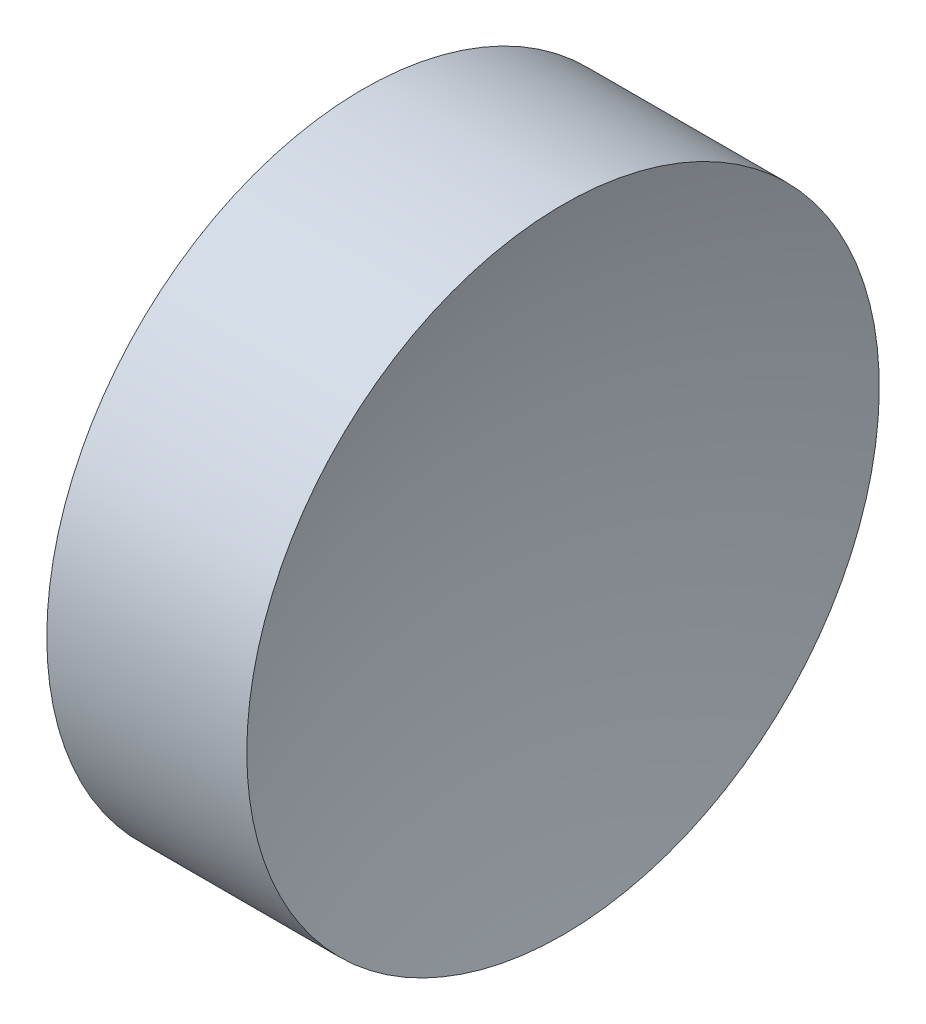
ISO-10303-21;
HEADER;
FILE_DESCRIPTION(('STEP AP214'),'2;1');
FILE_NAME('part.step','',(''),(''),'','','');
FILE_SCHEMA(('AUTOMOTIVE_DESIGN { 1 0 10303 214 1 1 1 1 }'));
ENDSEC;
DATA;
#1=APPLICATION_CONTEXT('core data for automotive mechanical design processes');
#2=APPLICATION_PROTOCOL_DEFINITION('international standard','automotive_design',2000,#1);
#3=PRODUCT_CONTEXT('',#1,'mechanical');
#4=PRODUCT('Part','Part','',(#3));
#5=PRODUCT_RELATED_PRODUCT_CATEGORY('part','',(#4));
#6=PRODUCT_DEFINITION_FORMATION('','',#4);
#7=PRODUCT_DEFINITION_CONTEXT('part definition',#1,'design');
#8=PRODUCT_DEFINITION('design','',#6,#7);
#9=PRODUCT_DEFINITION_SHAPE('','',#8);
#10=(LENGTH_UNIT() NAMED_UNIT(*) SI_UNIT(.MILLI.,.METRE.));
#11=(NAMED_UNIT(*) PLANE_ANGLE_UNIT() SI_UNIT($,.RADIAN.));
#12=(NAMED_UNIT(*) SI_UNIT($,.STERADIAN.) SOLID_ANGLE_UNIT());
#13=UNCERTAINTY_MEASURE_WITH_UNIT(LENGTH_MEASURE(1.E-05),#10,'distance_accuracy_value','');
#14=(GEOMETRIC_REPRESENTATION_CONTEXT(3) GLOBAL_UNCERTAINTY_ASSIGNED_CONTEXT((#13)) GLOBAL_UNIT_ASSIGNED_CONTEXT((#10,
#11,#12)) REPRESENTATION_CONTEXT('',''));
#15=CARTESIAN_POINT('',(0.,0.,0.));
#16=DIRECTION('',(0.,0.,1.));
#17=DIRECTION('',(1.,0.,0.));
#18=AXIS2_PLACEMENT_3D('',#15,#16,#17);
#19=CARTESIAN_POINT('',(34.1392688325745,13.031126091403,0.));
#20=DIRECTION('',(-1.,0.,0.));
#21=DIRECTION('',(0.,-1.,0.));
#22=AXIS2_PLACEMENT_3D('',#19,#20,#21);
#23=SPHERICAL_SURFACE('',#22,10.33);
#24=CARTESIAN_POINT('',(24.3012609041369,13.031126091403,0.));
#25=DIRECTION('',(-1.,0.,0.));
#26=DIRECTION('',(0.,0.,1.));
#27=AXIS2_PLACEMENT_3D('',#24,#25,#26);
#28=CIRCLE('',#27,3.15);
#29=CARTESIAN_POINT('',(24.3012609041369,13.031126091403,3.15));
#30=VERTEX_POINT('',#29);
#31=EDGE_CURVE('E10',#30,#30,#28,.T.);
#32=ORIENTED_EDGE('',*,*,#31,.F.);
#33=EDGE_LOOP('',(#32));
#34=FACE_BOUND('',#33,.T.);
#35=ADVANCED_FACE('F35',(#34),#23,.F.);
#36=CARTESIAN_POINT('',(20.6840306351329,13.031126091403,0.));
#37=DIRECTION('',(-1.,0.,0.));
#38=DIRECTION('',(0.,0.,1.));
#39=AXIS2_PLACEMENT_3D('',#36,#37,#38);
#40=CYLINDRICAL_SURFACE('',#39,3.15);
#41=CARTESIAN_POINT('',(22.3092688325745,13.031126091403,0.));
#42=DIRECTION('',(-1.,0.,0.));
#43=DIRECTION('',(0.,0.,1.));
#44=AXIS2_PLACEMENT_3D('',#41,#42,#43);
#45=CIRCLE('',#44,3.15);
#46=CARTESIAN_POINT('',(22.3092688325745,13.031126091403,3.15));
#47=VERTEX_POINT('',#46);
#48=EDGE_CURVE('E41',#47,#47,#45,.T.);
#49=ORIENTED_EDGE('',*,*,#48,.F.);
#50=EDGE_LOOP('',(#49));
#51=FACE_BOUND('',#50,.T.);
#52=ORIENTED_EDGE('',*,*,#31,.T.);
#53=EDGE_LOOP('',(#52));
#54=FACE_BOUND('',#53,.T.);
#55=ADVANCED_FACE('F49',(#51,#54),#40,.T.);
#56=CARTESIAN_POINT('',(22.3092688325745,13.031126091403,0.));
#57=DIRECTION('',(1.,0.,0.));
#58=DIRECTION('',(0.,0.,-1.));
#59=AXIS2_PLACEMENT_3D('',#56,#57,#58);
#60=PLANE('',#59);
#61=ORIENTED_EDGE('',*,*,#48,.T.);
#62=EDGE_LOOP('',(#61));
#63=FACE_BOUND('',#62,.T.);
#64=ADVANCED_FACE('F47',(#63),#60,.F.);
#65=CLOSED_SHELL('',(#35,#55,#64));
#66=MANIFOLD_SOLID_BREP('B2',#65);
#67=ADVANCED_BREP_SHAPE_REPRESENTATION('',(#18,#66),#14);
#68=SHAPE_DEFINITION_REPRESENTATION(#9,#67);
ENDSEC;
END-ISO-10303-21;
